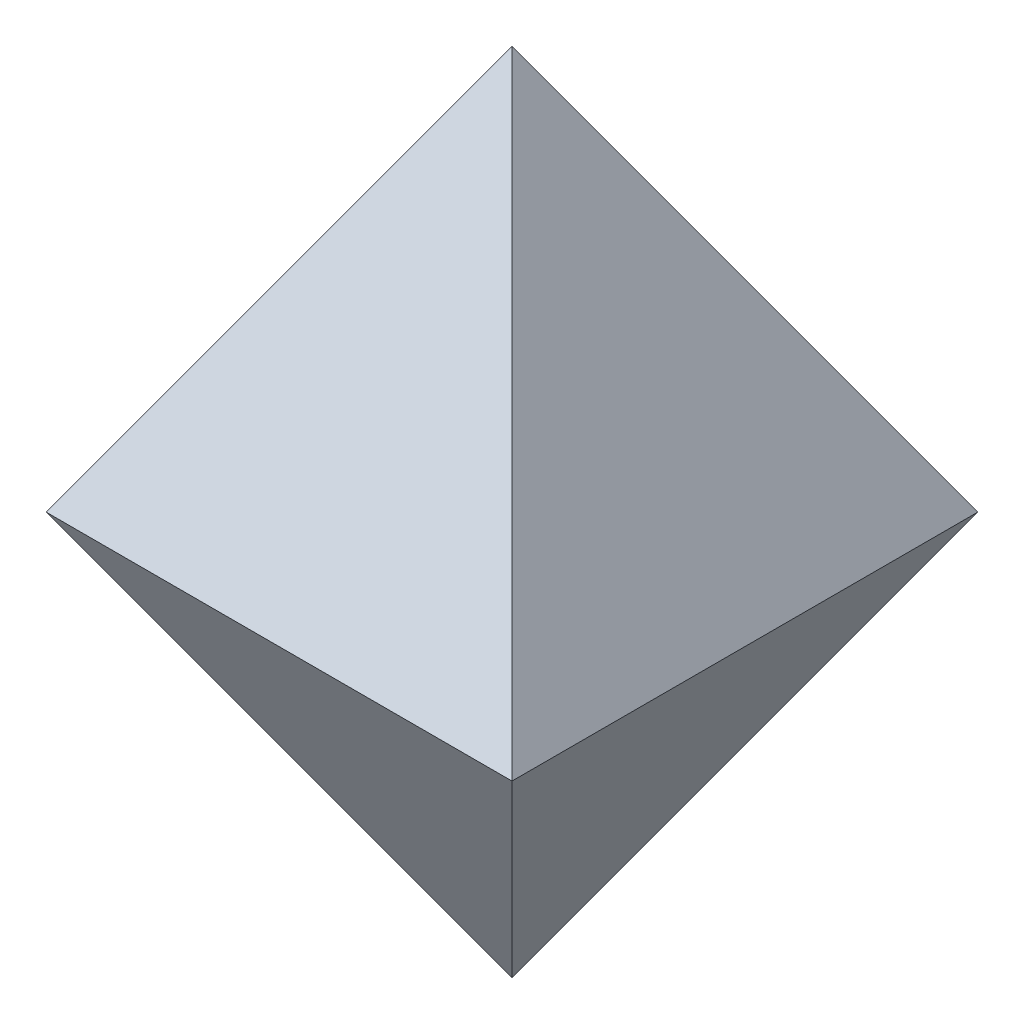
ISO-10303-21;
HEADER;
FILE_DESCRIPTION(('STEP AP214'),'2;1');
FILE_NAME('part.step','',(''),(''),'','','');
FILE_SCHEMA(('AUTOMOTIVE_DESIGN { 1 0 10303 214 1 1 1 1 }'));
ENDSEC;
DATA;
#1=APPLICATION_CONTEXT('core data for automotive mechanical design processes');
#2=APPLICATION_PROTOCOL_DEFINITION('international standard','automotive_design',2000,#1);
#3=PRODUCT_CONTEXT('',#1,'mechanical');
#4=PRODUCT('Part','Part','',(#3));
#5=PRODUCT_RELATED_PRODUCT_CATEGORY('part','',(#4));
#6=PRODUCT_DEFINITION_FORMATION('','',#4);
#7=PRODUCT_DEFINITION_CONTEXT('part definition',#1,'design');
#8=PRODUCT_DEFINITION('design','',#6,#7);
#9=PRODUCT_DEFINITION_SHAPE('','',#8);
#10=(LENGTH_UNIT() NAMED_UNIT(*) SI_UNIT(.MILLI.,.METRE.));
#11=(NAMED_UNIT(*) PLANE_ANGLE_UNIT() SI_UNIT($,.RADIAN.));
#12=(NAMED_UNIT(*) SI_UNIT($,.STERADIAN.) SOLID_ANGLE_UNIT());
#13=UNCERTAINTY_MEASURE_WITH_UNIT(LENGTH_MEASURE(1.E-05),#10,'distance_accuracy_value','');
#14=(GEOMETRIC_REPRESENTATION_CONTEXT(3) GLOBAL_UNCERTAINTY_ASSIGNED_CONTEXT((#13)) GLOBAL_UNIT_ASSIGNED_CONTEXT((#10,
#11,#12)) REPRESENTATION_CONTEXT('',''));
#15=CARTESIAN_POINT('',(0.,0.,0.));
#16=DIRECTION('',(0.,0.,1.));
#17=DIRECTION('',(1.,0.,0.));
#18=AXIS2_PLACEMENT_3D('',#15,#16,#17);
#19=CARTESIAN_POINT('',(5.,0.,5.));
#20=DIRECTION('',(0.866025403784438,0.500000000000001,0.));
#21=DIRECTION('',(-0.500000000000001,0.866025403784438,0.));
#22=AXIS2_PLACEMENT_3D('',#19,#20,#21);
#23=PLANE('',#22);
#24=DIRECTION('',(0.,0.,-1.));
#25=VECTOR('',#24,1.);
#26=CARTESIAN_POINT('',(5.,0.,5.));
#27=LINE('',#26,#25);
#28=CARTESIAN_POINT('',(5.,0.,5.));
#29=VERTEX_POINT('',#28);
#30=CARTESIAN_POINT('',(5.,0.,-5.));
#31=VERTEX_POINT('',#30);
#32=EDGE_CURVE('E80',#29,#31,#27,.T.);
#33=ORIENTED_EDGE('',*,*,#32,.T.);
#34=DIRECTION('',(0.447213595499959,-0.774596669241482,-0.447213595499959));
#35=VECTOR('',#34,1.);
#36=CARTESIAN_POINT('',(2.99999999999999,3.46410161513776,-3.));
#37=LINE('',#36,#35);
#38=CARTESIAN_POINT('',(0.,8.66025403784429,0.));
#39=VERTEX_POINT('',#38);
#40=EDGE_CURVE('E11',#39,#31,#37,.T.);
#41=ORIENTED_EDGE('',*,*,#40,.F.);
#42=DIRECTION('',(0.447213595499959,-0.774596669241482,0.447213595499959));
#43=VECTOR('',#42,1.);
#44=CARTESIAN_POINT('',(5.,0.,5.));
#45=LINE('',#44,#43);
#46=EDGE_CURVE('E96',#39,#29,#45,.T.);
#47=ORIENTED_EDGE('',*,*,#46,.T.);
#48=EDGE_LOOP('',(#33,#41,#47));
#49=FACE_BOUND('',#48,.T.);
#50=ADVANCED_FACE('F36',(#49),#23,.T.);
#51=CARTESIAN_POINT('',(-5.,0.,-5.));
#52=DIRECTION('',(0.,0.500000000000001,-0.866025403784438));
#53=DIRECTION('',(0.,0.866025403784438,0.500000000000001));
#54=AXIS2_PLACEMENT_3D('',#51,#52,#53);
#55=PLANE('',#54);
#56=DIRECTION('',(-1.,0.,0.));
#57=VECTOR('',#56,1.);
#58=CARTESIAN_POINT('',(-5.,0.,-5.));
#59=LINE('',#58,#57);
#60=CARTESIAN_POINT('',(-5.,0.,-5.));
#61=VERTEX_POINT('',#60);
#62=EDGE_CURVE('E90',#31,#61,#59,.T.);
#63=ORIENTED_EDGE('',*,*,#62,.T.);
#64=DIRECTION('',(-0.447213595499959,-0.774596669241482,-0.447213595499959));
#65=VECTOR('',#64,1.);
#66=CARTESIAN_POINT('',(-2.99999999999999,3.46410161513776,-2.99999999999999));
#67=LINE('',#66,#65);
#68=EDGE_CURVE('E40',#39,#61,#67,.T.);
#69=ORIENTED_EDGE('',*,*,#68,.F.);
#70=ORIENTED_EDGE('',*,*,#40,.T.);
#71=EDGE_LOOP('',(#63,#69,#70));
#72=FACE_BOUND('',#71,.T.);
#73=ADVANCED_FACE('F38',(#72),#55,.T.);
#74=CARTESIAN_POINT('',(-5.,0.,5.));
#75=DIRECTION('',(-0.866025403784438,0.500000000000001,0.));
#76=DIRECTION('',(-0.500000000000001,-0.866025403784438,0.));
#77=AXIS2_PLACEMENT_3D('',#74,#75,#76);
#78=PLANE('',#77);
#79=DIRECTION('',(0.,0.,1.));
#80=VECTOR('',#79,1.);
#81=CARTESIAN_POINT('',(-5.,0.,5.));
#82=LINE('',#81,#80);
#83=CARTESIAN_POINT('',(-5.,0.,5.));
#84=VERTEX_POINT('',#83);
#85=EDGE_CURVE('E58',#61,#84,#82,.T.);
#86=ORIENTED_EDGE('',*,*,#85,.T.);
#87=DIRECTION('',(-0.447213595499959,-0.774596669241482,0.447213595499959));
#88=VECTOR('',#87,1.);
#89=CARTESIAN_POINT('',(-5.,0.,5.));
#90=LINE('',#89,#88);
#91=EDGE_CURVE('E97',#39,#84,#90,.T.);
#92=ORIENTED_EDGE('',*,*,#91,.F.);
#93=ORIENTED_EDGE('',*,*,#68,.T.);
#94=EDGE_LOOP('',(#86,#92,#93));
#95=FACE_BOUND('',#94,.T.);
#96=ADVANCED_FACE('F109',(#95),#78,.T.);
#97=CARTESIAN_POINT('',(-5.,0.,5.));
#98=DIRECTION('',(0.,0.500000000000001,0.866025403784438));
#99=DIRECTION('',(0.,-0.866025403784438,0.500000000000001));
#100=AXIS2_PLACEMENT_3D('',#97,#98,#99);
#101=PLANE('',#100);
#102=DIRECTION('',(1.,0.,0.));
#103=VECTOR('',#102,1.);
#104=CARTESIAN_POINT('',(-5.,0.,5.));
#105=LINE('',#104,#103);
#106=EDGE_CURVE('E77',#84,#29,#105,.T.);
#107=ORIENTED_EDGE('',*,*,#106,.T.);
#108=ORIENTED_EDGE('',*,*,#46,.F.);
#109=ORIENTED_EDGE('',*,*,#91,.T.);
#110=EDGE_LOOP('',(#107,#108,#109));
#111=FACE_BOUND('',#110,.T.);
#112=ADVANCED_FACE('F95',(#111),#101,.T.);
#113=CARTESIAN_POINT('',(5.,0.,5.));
#114=DIRECTION('',(0.866025403784438,-0.500000000000001,0.));
#115=DIRECTION('',(0.500000000000001,0.866025403784438,0.));
#116=AXIS2_PLACEMENT_3D('',#113,#114,#115);
#117=PLANE('',#116);
#118=ORIENTED_EDGE('',*,*,#32,.F.);
#119=DIRECTION('',(0.447213595499959,0.774596669241482,0.447213595499959));
#120=VECTOR('',#119,1.);
#121=CARTESIAN_POINT('',(2.99999999999999,-3.46410161513776,2.99999999999999));
#122=LINE('',#121,#120);
#123=CARTESIAN_POINT('',(0.,-8.66025403784429,0.));
#124=VERTEX_POINT('',#123);
#125=EDGE_CURVE('E73',#124,#29,#122,.T.);
#126=ORIENTED_EDGE('',*,*,#125,.F.);
#127=DIRECTION('',(0.447213595499959,0.774596669241482,-0.447213595499959));
#128=VECTOR('',#127,1.);
#129=CARTESIAN_POINT('',(3.,-3.46410161513776,-2.99999999999999));
#130=LINE('',#129,#128);
#131=EDGE_CURVE('E85',#124,#31,#130,.T.);
#132=ORIENTED_EDGE('',*,*,#131,.T.);
#133=EDGE_LOOP('',(#118,#126,#132));
#134=FACE_BOUND('',#133,.T.);
#135=ADVANCED_FACE('F83',(#134),#117,.T.);
#136=CARTESIAN_POINT('',(-5.,0.,5.));
#137=DIRECTION('',(0.,-0.500000000000001,0.866025403784438));
#138=DIRECTION('',(0.,-0.866025403784438,-0.500000000000001));
#139=AXIS2_PLACEMENT_3D('',#136,#137,#138);
#140=PLANE('',#139);
#141=ORIENTED_EDGE('',*,*,#106,.F.);
#142=DIRECTION('',(-0.447213595499959,0.774596669241482,0.447213595499959));
#143=VECTOR('',#142,1.);
#144=CARTESIAN_POINT('',(-5.,0.,5.));
#145=LINE('',#144,#143);
#146=EDGE_CURVE('E78',#124,#84,#145,.T.);
#147=ORIENTED_EDGE('',*,*,#146,.F.);
#148=ORIENTED_EDGE('',*,*,#125,.T.);
#149=EDGE_LOOP('',(#141,#147,#148));
#150=FACE_BOUND('',#149,.T.);
#151=ADVANCED_FACE('F75',(#150),#140,.T.);
#152=CARTESIAN_POINT('',(-5.,0.,5.));
#153=DIRECTION('',(-0.866025403784438,-0.500000000000001,0.));
#154=DIRECTION('',(0.500000000000001,-0.866025403784438,0.));
#155=AXIS2_PLACEMENT_3D('',#152,#153,#154);
#156=PLANE('',#155);
#157=ORIENTED_EDGE('',*,*,#85,.F.);
#158=DIRECTION('',(-0.447213595499959,0.774596669241482,-0.447213595499959));
#159=VECTOR('',#158,1.);
#160=CARTESIAN_POINT('',(-5.,0.,-5.));
#161=LINE('',#160,#159);
#162=EDGE_CURVE('E104',#124,#61,#161,.T.);
#163=ORIENTED_EDGE('',*,*,#162,.F.);
#164=ORIENTED_EDGE('',*,*,#146,.T.);
#165=EDGE_LOOP('',(#157,#163,#164));
#166=FACE_BOUND('',#165,.T.);
#167=ADVANCED_FACE('F123',(#166),#156,.T.);
#168=CARTESIAN_POINT('',(-5.,0.,-5.));
#169=DIRECTION('',(0.,-0.500000000000001,-0.866025403784438));
#170=DIRECTION('',(0.,0.866025403784438,-0.500000000000001));
#171=AXIS2_PLACEMENT_3D('',#168,#169,#170);
#172=PLANE('',#171);
#173=ORIENTED_EDGE('',*,*,#62,.F.);
#174=ORIENTED_EDGE('',*,*,#131,.F.);
#175=ORIENTED_EDGE('',*,*,#162,.T.);
#176=EDGE_LOOP('',(#173,#174,#175));
#177=FACE_BOUND('',#176,.T.);
#178=ADVANCED_FACE('F107',(#177),#172,.T.);
#179=CLOSED_SHELL('',(#50,#73,#96,#112,#135,#151,#167,#178));
#180=MANIFOLD_SOLID_BREP('B2',#179);
#181=ADVANCED_BREP_SHAPE_REPRESENTATION('',(#18,#180),#14);
#182=SHAPE_DEFINITION_REPRESENTATION(#9,#181);
ENDSEC;
END-ISO-10303-21;
